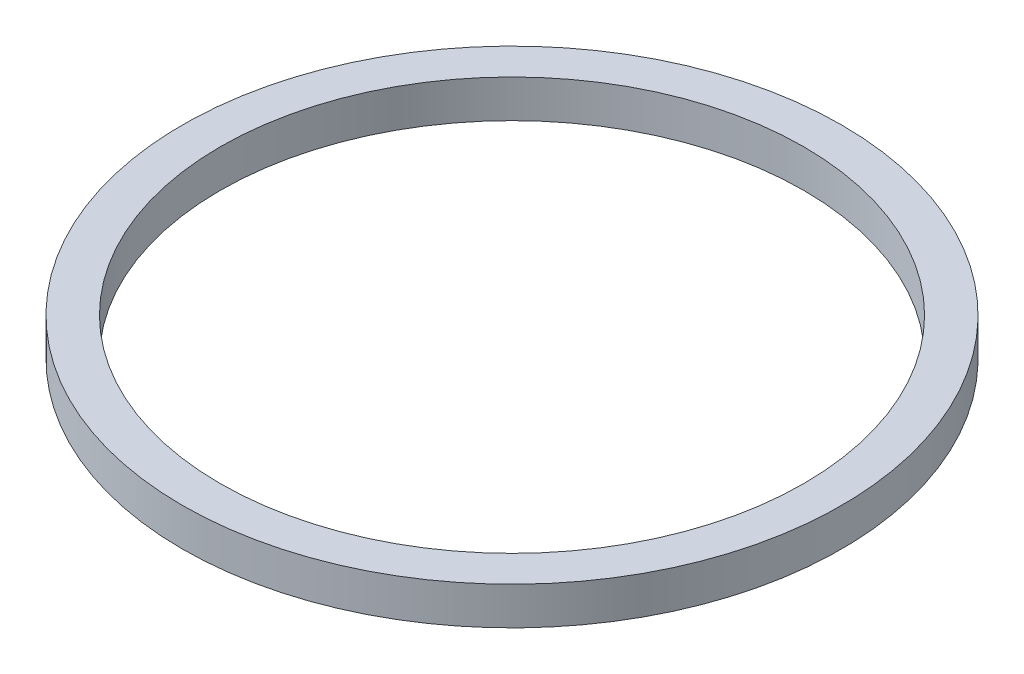
ISO-10303-21;
HEADER;
FILE_DESCRIPTION(('STEP AP214'),'2;1');
FILE_NAME('part.step','',(''),(''),'','','');
FILE_SCHEMA(('AUTOMOTIVE_DESIGN { 1 0 10303 214 1 1 1 1 }'));
ENDSEC;
DATA;
#1=APPLICATION_CONTEXT('core data for automotive mechanical design processes');
#2=APPLICATION_PROTOCOL_DEFINITION('international standard','automotive_design',2000,#1);
#3=PRODUCT_CONTEXT('',#1,'mechanical');
#4=PRODUCT('Part','Part','',(#3));
#5=PRODUCT_RELATED_PRODUCT_CATEGORY('part','',(#4));
#6=PRODUCT_DEFINITION_FORMATION('','',#4);
#7=PRODUCT_DEFINITION_CONTEXT('part definition',#1,'design');
#8=PRODUCT_DEFINITION('design','',#6,#7);
#9=PRODUCT_DEFINITION_SHAPE('','',#8);
#10=(LENGTH_UNIT() NAMED_UNIT(*) SI_UNIT(.MILLI.,.METRE.));
#11=(NAMED_UNIT(*) PLANE_ANGLE_UNIT() SI_UNIT($,.RADIAN.));
#12=(NAMED_UNIT(*) SI_UNIT($,.STERADIAN.) SOLID_ANGLE_UNIT());
#13=UNCERTAINTY_MEASURE_WITH_UNIT(LENGTH_MEASURE(1.E-05),#10,'distance_accuracy_value','');
#14=(GEOMETRIC_REPRESENTATION_CONTEXT(3) GLOBAL_UNCERTAINTY_ASSIGNED_CONTEXT((#13)) GLOBAL_UNIT_ASSIGNED_CONTEXT((#10,
#11,#12)) REPRESENTATION_CONTEXT('',''));
#15=CARTESIAN_POINT('',(0.,0.,0.));
#16=DIRECTION('',(0.,0.,1.));
#17=DIRECTION('',(1.,0.,0.));
#18=AXIS2_PLACEMENT_3D('',#15,#16,#17);
#19=CARTESIAN_POINT('',(0.,0.,0.));
#20=DIRECTION('',(0.,-1.,0.));
#21=DIRECTION('',(0.,0.,-1.));
#22=AXIS2_PLACEMENT_3D('',#19,#20,#21);
#23=CYLINDRICAL_SURFACE('',#22,108.);
#24=CARTESIAN_POINT('',(0.,-7.,0.));
#25=DIRECTION('',(0.,-1.,0.));
#26=DIRECTION('',(0.,0.,-1.));
#27=AXIS2_PLACEMENT_3D('',#24,#25,#26);
#28=CIRCLE('',#27,108.);
#29=CARTESIAN_POINT('',(0.,-7.,-108.));
#30=VERTEX_POINT('',#29);
#31=EDGE_CURVE('E10',#30,#30,#28,.T.);
#32=ORIENTED_EDGE('',*,*,#31,.T.);
#33=EDGE_LOOP('',(#32));
#34=FACE_BOUND('',#33,.T.);
#35=CARTESIAN_POINT('',(0.,7.,0.));
#36=DIRECTION('',(0.,-1.,0.));
#37=DIRECTION('',(0.,0.,-1.));
#38=AXIS2_PLACEMENT_3D('',#35,#36,#37);
#39=CIRCLE('',#38,108.);
#40=CARTESIAN_POINT('',(0.,7.,-108.));
#41=VERTEX_POINT('',#40);
#42=EDGE_CURVE('E47',#41,#41,#39,.T.);
#43=ORIENTED_EDGE('',*,*,#42,.F.);
#44=EDGE_LOOP('',(#43));
#45=FACE_BOUND('',#44,.T.);
#46=ADVANCED_FACE('F33',(#34,#45),#23,.F.);
#47=CARTESIAN_POINT('',(108.,-7.,0.));
#48=DIRECTION('',(0.,-1.,0.));
#49=DIRECTION('',(0.,0.,-1.));
#50=AXIS2_PLACEMENT_3D('',#47,#48,#49);
#51=PLANE('',#50);
#52=CARTESIAN_POINT('',(0.,-7.,0.));
#53=DIRECTION('',(0.,-1.,0.));
#54=DIRECTION('',(0.,0.,-1.));
#55=AXIS2_PLACEMENT_3D('',#52,#53,#54);
#56=CIRCLE('',#55,122.);
#57=CARTESIAN_POINT('',(0.,-7.,-122.));
#58=VERTEX_POINT('',#57);
#59=EDGE_CURVE('E39',#58,#58,#56,.T.);
#60=ORIENTED_EDGE('',*,*,#59,.T.);
#61=EDGE_LOOP('',(#60));
#62=FACE_BOUND('',#61,.T.);
#63=ORIENTED_EDGE('',*,*,#31,.F.);
#64=EDGE_LOOP('',(#63));
#65=FACE_BOUND('',#64,.T.);
#66=ADVANCED_FACE('F57',(#62,#65),#51,.T.);
#67=CARTESIAN_POINT('',(0.,0.,0.));
#68=DIRECTION('',(0.,-1.,0.));
#69=DIRECTION('',(0.,0.,-1.));
#70=AXIS2_PLACEMENT_3D('',#67,#68,#69);
#71=CYLINDRICAL_SURFACE('',#70,122.);
#72=CARTESIAN_POINT('',(0.,7.,0.));
#73=DIRECTION('',(0.,-1.,0.));
#74=DIRECTION('',(0.,0.,-1.));
#75=AXIS2_PLACEMENT_3D('',#72,#73,#74);
#76=CIRCLE('',#75,122.);
#77=CARTESIAN_POINT('',(0.,7.,-122.));
#78=VERTEX_POINT('',#77);
#79=EDGE_CURVE('E43',#78,#78,#76,.T.);
#80=ORIENTED_EDGE('',*,*,#79,.T.);
#81=EDGE_LOOP('',(#80));
#82=FACE_BOUND('',#81,.T.);
#83=ORIENTED_EDGE('',*,*,#59,.F.);
#84=EDGE_LOOP('',(#83));
#85=FACE_BOUND('',#84,.T.);
#86=ADVANCED_FACE('F61',(#82,#85),#71,.T.);
#87=CARTESIAN_POINT('',(108.,7.,0.));
#88=DIRECTION('',(0.,1.,0.));
#89=DIRECTION('',(0.,0.,1.));
#90=AXIS2_PLACEMENT_3D('',#87,#88,#89);
#91=PLANE('',#90);
#92=ORIENTED_EDGE('',*,*,#42,.T.);
#93=EDGE_LOOP('',(#92));
#94=FACE_BOUND('',#93,.T.);
#95=ORIENTED_EDGE('',*,*,#79,.F.);
#96=EDGE_LOOP('',(#95));
#97=FACE_BOUND('',#96,.T.);
#98=ADVANCED_FACE('F53',(#94,#97),#91,.T.);
#99=CLOSED_SHELL('',(#46,#66,#86,#98));
#100=MANIFOLD_SOLID_BREP('B2',#99);
#101=ADVANCED_BREP_SHAPE_REPRESENTATION('',(#18,#100),#14);
#102=SHAPE_DEFINITION_REPRESENTATION(#9,#101);
ENDSEC;
END-ISO-10303-21;
